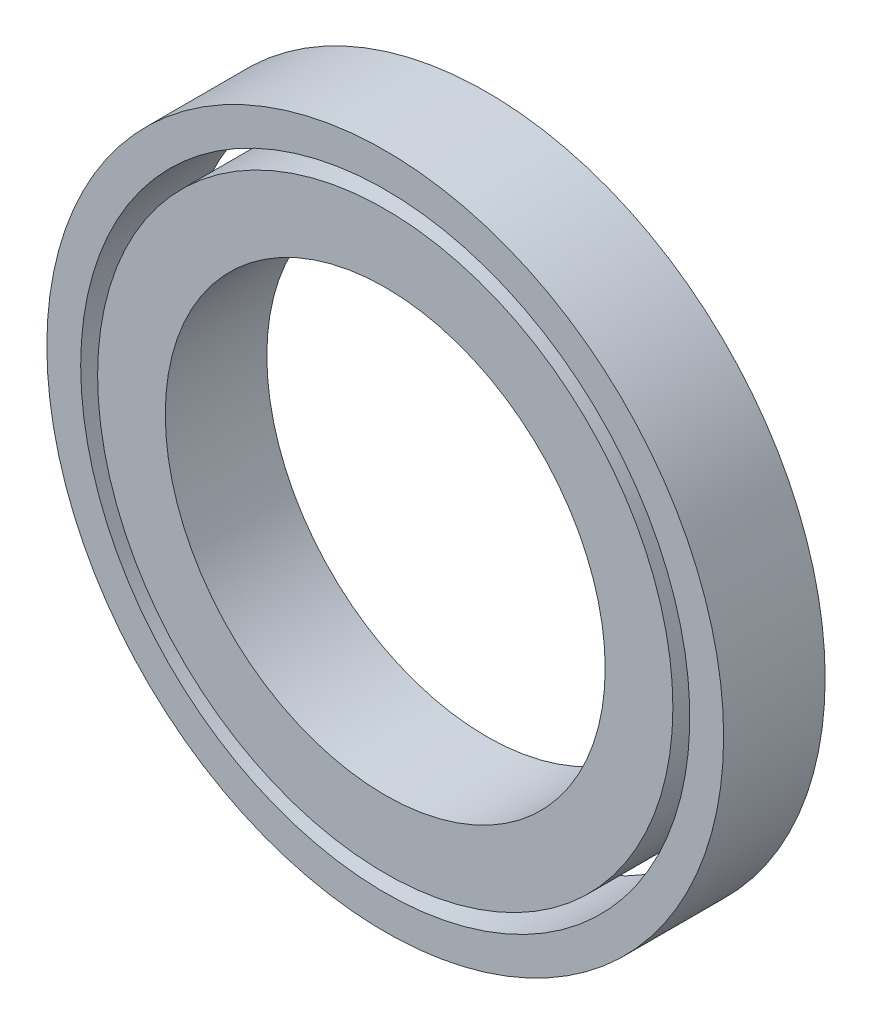
ISO-10303-21;
HEADER;
FILE_DESCRIPTION(('STEP AP214'),'2;1');
FILE_NAME('part.step','',(''),(''),'','','');
FILE_SCHEMA(('AUTOMOTIVE_DESIGN { 1 0 10303 214 1 1 1 1 }'));
ENDSEC;
DATA;
#1=APPLICATION_CONTEXT('core data for automotive mechanical design processes');
#2=APPLICATION_PROTOCOL_DEFINITION('international standard','automotive_design',2000,#1);
#3=PRODUCT_CONTEXT('',#1,'mechanical');
#4=PRODUCT('Part','Part','',(#3));
#5=PRODUCT_RELATED_PRODUCT_CATEGORY('part','',(#4));
#6=PRODUCT_DEFINITION_FORMATION('','',#4);
#7=PRODUCT_DEFINITION_CONTEXT('part definition',#1,'design');
#8=PRODUCT_DEFINITION('design','',#6,#7);
#9=PRODUCT_DEFINITION_SHAPE('','',#8);
#10=(LENGTH_UNIT() NAMED_UNIT(*) SI_UNIT(.MILLI.,.METRE.));
#11=(NAMED_UNIT(*) PLANE_ANGLE_UNIT() SI_UNIT($,.RADIAN.));
#12=(NAMED_UNIT(*) SI_UNIT($,.STERADIAN.) SOLID_ANGLE_UNIT());
#13=UNCERTAINTY_MEASURE_WITH_UNIT(LENGTH_MEASURE(1.E-05),#10,'distance_accuracy_value','');
#14=(GEOMETRIC_REPRESENTATION_CONTEXT(3) GLOBAL_UNCERTAINTY_ASSIGNED_CONTEXT((#13)) GLOBAL_UNIT_ASSIGNED_CONTEXT((#10,
#11,#12)) REPRESENTATION_CONTEXT('',''));
#15=CARTESIAN_POINT('',(0.,0.,0.));
#16=DIRECTION('',(0.,0.,1.));
#17=DIRECTION('',(1.,0.,0.));
#18=AXIS2_PLACEMENT_3D('',#15,#16,#17);
#19=CARTESIAN_POINT('',(0.,0.,6.));
#20=DIRECTION('',(0.,0.,-1.));
#21=DIRECTION('',(-1.,0.,0.));
#22=AXIS2_PLACEMENT_3D('',#19,#20,#21);
#23=CYLINDRICAL_SURFACE('',#22,20.);
#24=CARTESIAN_POINT('',(0.,0.,6.));
#25=DIRECTION('',(0.,0.,-1.));
#26=DIRECTION('',(-1.,0.,0.));
#27=AXIS2_PLACEMENT_3D('',#24,#25,#26);
#28=CIRCLE('',#27,20.);
#29=CARTESIAN_POINT('',(-20.,0.,6.));
#30=VERTEX_POINT('',#29);
#31=EDGE_CURVE('E11',#30,#30,#28,.T.);
#32=ORIENTED_EDGE('',*,*,#31,.T.);
#33=EDGE_LOOP('',(#32));
#34=FACE_BOUND('',#33,.T.);
#35=CARTESIAN_POINT('',(0.,0.,0.));
#36=DIRECTION('',(0.,0.,-1.));
#37=DIRECTION('',(-1.,0.,0.));
#38=AXIS2_PLACEMENT_3D('',#35,#36,#37);
#39=CIRCLE('',#38,20.);
#40=CARTESIAN_POINT('',(-20.,0.,0.));
#41=VERTEX_POINT('',#40);
#42=EDGE_CURVE('E48',#41,#41,#39,.T.);
#43=ORIENTED_EDGE('',*,*,#42,.F.);
#44=EDGE_LOOP('',(#43));
#45=FACE_BOUND('',#44,.T.);
#46=ADVANCED_FACE('F45',(#34,#45),#23,.T.);
#47=CARTESIAN_POINT('',(0.,0.,6.));
#48=DIRECTION('',(0.,0.,-1.));
#49=DIRECTION('',(-1.,0.,0.));
#50=AXIS2_PLACEMENT_3D('',#47,#48,#49);
#51=PLANE('',#50);
#52=CARTESIAN_POINT('',(0.,0.,6.));
#53=DIRECTION('',(0.,0.,-1.));
#54=DIRECTION('',(-1.,0.,0.));
#55=AXIS2_PLACEMENT_3D('',#52,#53,#54);
#56=CIRCLE('',#55,18.);
#57=CARTESIAN_POINT('',(-18.,0.,6.));
#58=VERTEX_POINT('',#57);
#59=EDGE_CURVE('E55',#58,#58,#56,.T.);
#60=ORIENTED_EDGE('',*,*,#59,.T.);
#61=EDGE_LOOP('',(#60));
#62=FACE_BOUND('',#61,.T.);
#63=ORIENTED_EDGE('',*,*,#31,.F.);
#64=EDGE_LOOP('',(#63));
#65=FACE_BOUND('',#64,.T.);
#66=ADVANCED_FACE('F63',(#62,#65),#51,.F.);
#67=CARTESIAN_POINT('',(0.,0.,0.));
#68=DIRECTION('',(0.,0.,-1.));
#69=DIRECTION('',(-1.,0.,0.));
#70=AXIS2_PLACEMENT_3D('',#67,#68,#69);
#71=PLANE('',#70);
#72=CARTESIAN_POINT('',(0.,0.,0.));
#73=DIRECTION('',(0.,0.,-1.));
#74=DIRECTION('',(-1.,0.,0.));
#75=AXIS2_PLACEMENT_3D('',#72,#73,#74);
#76=CIRCLE('',#75,18.);
#77=CARTESIAN_POINT('',(-18.,0.,0.));
#78=VERTEX_POINT('',#77);
#79=EDGE_CURVE('E57',#78,#78,#76,.T.);
#80=ORIENTED_EDGE('',*,*,#79,.F.);
#81=EDGE_LOOP('',(#80));
#82=FACE_BOUND('',#81,.T.);
#83=ORIENTED_EDGE('',*,*,#42,.T.);
#84=EDGE_LOOP('',(#83));
#85=FACE_BOUND('',#84,.T.);
#86=ADVANCED_FACE('F69',(#82,#85),#71,.T.);
#87=CARTESIAN_POINT('',(0.,0.,6.));
#88=DIRECTION('',(0.,0.,-1.));
#89=DIRECTION('',(-1.,0.,0.));
#90=AXIS2_PLACEMENT_3D('',#87,#88,#89);
#91=CYLINDRICAL_SURFACE('',#90,18.);
#92=ORIENTED_EDGE('',*,*,#59,.F.);
#93=EDGE_LOOP('',(#92));
#94=FACE_BOUND('',#93,.T.);
#95=ORIENTED_EDGE('',*,*,#79,.T.);
#96=EDGE_LOOP('',(#95));
#97=FACE_BOUND('',#96,.T.);
#98=ADVANCED_FACE('F66',(#94,#97),#91,.F.);
#99=CLOSED_SHELL('',(#46,#66,#86,#98));
#100=MANIFOLD_SOLID_BREP('B2',#99);
#101=CARTESIAN_POINT('',(0.,0.,6.));
#102=DIRECTION('',(0.,0.,1.));
#103=DIRECTION('',(1.,0.,0.));
#104=AXIS2_PLACEMENT_3D('',#101,#102,#103);
#105=PLANE('',#104);
#106=CARTESIAN_POINT('',(0.,0.,6.));
#107=DIRECTION('',(0.,0.,1.));
#108=DIRECTION('',(1.,0.,0.));
#109=AXIS2_PLACEMENT_3D('',#106,#107,#108);
#110=CIRCLE('',#109,17.);
#111=CARTESIAN_POINT('',(17.,0.,6.));
#112=VERTEX_POINT('',#111);
#113=EDGE_CURVE('E44',#112,#112,#110,.T.);
#114=ORIENTED_EDGE('',*,*,#113,.T.);
#115=EDGE_LOOP('',(#114));
#116=FACE_BOUND('',#115,.T.);
#117=CARTESIAN_POINT('',(0.,0.,6.));
#118=DIRECTION('',(0.,0.,1.));
#119=DIRECTION('',(1.,0.,0.));
#120=AXIS2_PLACEMENT_3D('',#117,#118,#119);
#121=CIRCLE('',#120,13.);
#122=CARTESIAN_POINT('',(13.,0.,6.));
#123=VERTEX_POINT('',#122);
#124=EDGE_CURVE('E120',#123,#123,#121,.T.);
#125=ORIENTED_EDGE('',*,*,#124,.F.);
#126=EDGE_LOOP('',(#125));
#127=FACE_BOUND('',#126,.T.);
#128=ADVANCED_FACE('F107',(#116,#127),#105,.T.);
#129=CARTESIAN_POINT('',(0.,0.,0.));
#130=DIRECTION('',(0.,0.,1.));
#131=DIRECTION('',(1.,0.,0.));
#132=AXIS2_PLACEMENT_3D('',#129,#130,#131);
#133=PLANE('',#132);
#134=CARTESIAN_POINT('',(0.,0.,0.));
#135=DIRECTION('',(0.,0.,1.));
#136=DIRECTION('',(1.,0.,0.));
#137=AXIS2_PLACEMENT_3D('',#134,#135,#136);
#138=CIRCLE('',#137,17.);
#139=CARTESIAN_POINT('',(17.,0.,0.));
#140=VERTEX_POINT('',#139);
#141=EDGE_CURVE('E111',#140,#140,#138,.T.);
#142=ORIENTED_EDGE('',*,*,#141,.F.);
#143=EDGE_LOOP('',(#142));
#144=FACE_BOUND('',#143,.T.);
#145=CARTESIAN_POINT('',(0.,0.,0.));
#146=DIRECTION('',(0.,0.,1.));
#147=DIRECTION('',(1.,0.,0.));
#148=AXIS2_PLACEMENT_3D('',#145,#146,#147);
#149=CIRCLE('',#148,13.);
#150=CARTESIAN_POINT('',(13.,0.,0.));
#151=VERTEX_POINT('',#150);
#152=EDGE_CURVE('E122',#151,#151,#149,.T.);
#153=ORIENTED_EDGE('',*,*,#152,.T.);
#154=EDGE_LOOP('',(#153));
#155=FACE_BOUND('',#154,.T.);
#156=ADVANCED_FACE('F134',(#144,#155),#133,.F.);
#157=CARTESIAN_POINT('',(0.,0.,6.));
#158=DIRECTION('',(0.,0.,-1.));
#159=DIRECTION('',(-1.,0.,0.));
#160=AXIS2_PLACEMENT_3D('',#157,#158,#159);
#161=CYLINDRICAL_SURFACE('',#160,17.);
#162=ORIENTED_EDGE('',*,*,#113,.F.);
#163=EDGE_LOOP('',(#162));
#164=FACE_BOUND('',#163,.T.);
#165=ORIENTED_EDGE('',*,*,#141,.T.);
#166=EDGE_LOOP('',(#165));
#167=FACE_BOUND('',#166,.T.);
#168=ADVANCED_FACE('F109',(#164,#167),#161,.T.);
#169=CARTESIAN_POINT('',(0.,0.,6.));
#170=DIRECTION('',(0.,0.,-1.));
#171=DIRECTION('',(-1.,0.,0.));
#172=AXIS2_PLACEMENT_3D('',#169,#170,#171);
#173=CYLINDRICAL_SURFACE('',#172,13.);
#174=ORIENTED_EDGE('',*,*,#124,.T.);
#175=EDGE_LOOP('',(#174));
#176=FACE_BOUND('',#175,.T.);
#177=ORIENTED_EDGE('',*,*,#152,.F.);
#178=EDGE_LOOP('',(#177));
#179=FACE_BOUND('',#178,.T.);
#180=ADVANCED_FACE('F130',(#176,#179),#173,.F.);
#181=CLOSED_SHELL('',(#128,#156,#168,#180));
#182=MANIFOLD_SOLID_BREP('B6',#181);
#183=ADVANCED_BREP_SHAPE_REPRESENTATION('',(#18,#100,#182),#14);
#184=SHAPE_DEFINITION_REPRESENTATION(#9,#183);
ENDSEC;
END-ISO-10303-21;
